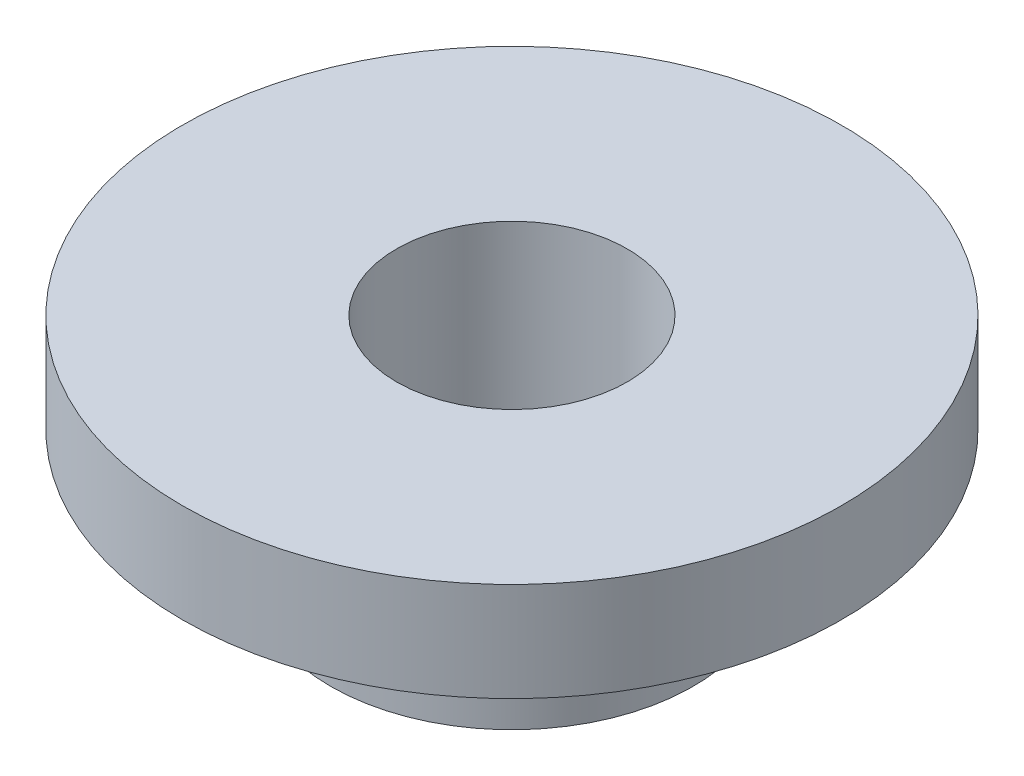
ISO-10303-21;
HEADER;
FILE_DESCRIPTION(('STEP AP214'),'2;1');
FILE_NAME('part.step','',(''),(''),'','','');
FILE_SCHEMA(('AUTOMOTIVE_DESIGN { 1 0 10303 214 1 1 1 1 }'));
ENDSEC;
DATA;
#1=APPLICATION_CONTEXT('core data for automotive mechanical design processes');
#2=APPLICATION_PROTOCOL_DEFINITION('international standard','automotive_design',2000,#1);
#3=PRODUCT_CONTEXT('',#1,'mechanical');
#4=PRODUCT('Part','Part','',(#3));
#5=PRODUCT_RELATED_PRODUCT_CATEGORY('part','',(#4));
#6=PRODUCT_DEFINITION_FORMATION('','',#4);
#7=PRODUCT_DEFINITION_CONTEXT('part definition',#1,'design');
#8=PRODUCT_DEFINITION('design','',#6,#7);
#9=PRODUCT_DEFINITION_SHAPE('','',#8);
#10=(LENGTH_UNIT() NAMED_UNIT(*) SI_UNIT(.MILLI.,.METRE.));
#11=(NAMED_UNIT(*) PLANE_ANGLE_UNIT() SI_UNIT($,.RADIAN.));
#12=(NAMED_UNIT(*) SI_UNIT($,.STERADIAN.) SOLID_ANGLE_UNIT());
#13=UNCERTAINTY_MEASURE_WITH_UNIT(LENGTH_MEASURE(1.E-05),#10,'distance_accuracy_value','');
#14=(GEOMETRIC_REPRESENTATION_CONTEXT(3) GLOBAL_UNCERTAINTY_ASSIGNED_CONTEXT((#13)) GLOBAL_UNIT_ASSIGNED_CONTEXT((#10,
#11,#12)) REPRESENTATION_CONTEXT('',''));
#15=CARTESIAN_POINT('',(0.,0.,0.));
#16=DIRECTION('',(0.,0.,1.));
#17=DIRECTION('',(1.,0.,0.));
#18=AXIS2_PLACEMENT_3D('',#15,#16,#17);
#19=CARTESIAN_POINT('',(-25.4,2.572,-2.66050878019847E-13));
#20=DIRECTION('',(0.,1.,0.));
#21=DIRECTION('',(0.,0.,1.));
#22=AXIS2_PLACEMENT_3D('',#19,#20,#21);
#23=CYLINDRICAL_SURFACE('',#22,2.75);
#24=CARTESIAN_POINT('',(-25.4,2.572,-2.66050878019847E-13));
#25=DIRECTION('',(0.,1.,0.));
#26=DIRECTION('',(0.,0.,1.));
#27=AXIS2_PLACEMENT_3D('',#24,#25,#26);
#28=CIRCLE('',#27,2.75);
#29=CARTESIAN_POINT('',(-25.4,2.572,2.74999999999973));
#30=VERTEX_POINT('',#29);
#31=EDGE_CURVE('E10',#30,#30,#28,.T.);
#32=ORIENTED_EDGE('',*,*,#31,.T.);
#33=EDGE_LOOP('',(#32));
#34=FACE_BOUND('',#33,.T.);
#35=CARTESIAN_POINT('',(-25.4,4.572,-2.66050878019847E-13));
#36=DIRECTION('',(0.,1.,0.));
#37=DIRECTION('',(0.,0.,1.));
#38=AXIS2_PLACEMENT_3D('',#35,#36,#37);
#39=CIRCLE('',#38,2.75);
#40=CARTESIAN_POINT('',(-25.4,4.572,2.74999999999973));
#41=VERTEX_POINT('',#40);
#42=EDGE_CURVE('E42',#41,#41,#39,.T.);
#43=ORIENTED_EDGE('',*,*,#42,.F.);
#44=EDGE_LOOP('',(#43));
#45=FACE_BOUND('',#44,.T.);
#46=ADVANCED_FACE('F39',(#34,#45),#23,.T.);
#47=CARTESIAN_POINT('',(-25.4,2.572,-2.66050878019847E-13));
#48=DIRECTION('',(0.,1.,0.));
#49=DIRECTION('',(0.,0.,1.));
#50=AXIS2_PLACEMENT_3D('',#47,#48,#49);
#51=PLANE('',#50);
#52=CARTESIAN_POINT('',(-25.4,2.572,-2.66050878019847E-13));
#53=DIRECTION('',(0.,1.,0.));
#54=DIRECTION('',(0.,0.,1.));
#55=AXIS2_PLACEMENT_3D('',#52,#53,#54);
#56=CIRCLE('',#55,1.75);
#57=CARTESIAN_POINT('',(-25.4,2.572,1.74999999999973));
#58=VERTEX_POINT('',#57);
#59=EDGE_CURVE('E51',#58,#58,#56,.T.);
#60=ORIENTED_EDGE('',*,*,#59,.T.);
#61=EDGE_LOOP('',(#60));
#62=FACE_BOUND('',#61,.T.);
#63=ORIENTED_EDGE('',*,*,#31,.F.);
#64=EDGE_LOOP('',(#63));
#65=FACE_BOUND('',#64,.T.);
#66=ADVANCED_FACE('F83',(#62,#65),#51,.F.);
#67=CARTESIAN_POINT('',(-25.4,2.572,-2.66050878019847E-13));
#68=DIRECTION('',(0.,1.,0.));
#69=DIRECTION('',(0.,0.,1.));
#70=AXIS2_PLACEMENT_3D('',#67,#68,#69);
#71=CYLINDRICAL_SURFACE('',#70,1.75);
#72=ORIENTED_EDGE('',*,*,#59,.F.);
#73=EDGE_LOOP('',(#72));
#74=FACE_BOUND('',#73,.T.);
#75=CARTESIAN_POINT('',(-25.4,6.072,-2.66050878019847E-13));
#76=DIRECTION('',(0.,1.,0.));
#77=DIRECTION('',(0.,0.,1.));
#78=AXIS2_PLACEMENT_3D('',#75,#76,#77);
#79=CIRCLE('',#78,1.75);
#80=CARTESIAN_POINT('',(-25.4,6.072,1.74999999999973));
#81=VERTEX_POINT('',#80);
#82=EDGE_CURVE('E61',#81,#81,#79,.T.);
#83=ORIENTED_EDGE('',*,*,#82,.T.);
#84=EDGE_LOOP('',(#83));
#85=FACE_BOUND('',#84,.T.);
#86=ADVANCED_FACE('F69',(#74,#85),#71,.F.);
#87=CARTESIAN_POINT('',(-25.4,6.072,-2.66050878019847E-13));
#88=DIRECTION('',(0.,1.,0.));
#89=DIRECTION('',(0.,0.,1.));
#90=AXIS2_PLACEMENT_3D('',#87,#88,#89);
#91=PLANE('',#90);
#92=CARTESIAN_POINT('',(-25.4,6.072,-2.66050878019847E-13));
#93=DIRECTION('',(0.,1.,0.));
#94=DIRECTION('',(0.,0.,1.));
#95=AXIS2_PLACEMENT_3D('',#92,#93,#94);
#96=CIRCLE('',#95,5.);
#97=CARTESIAN_POINT('',(-25.4,6.072,4.99999999999973));
#98=VERTEX_POINT('',#97);
#99=EDGE_CURVE('E56',#98,#98,#96,.T.);
#100=ORIENTED_EDGE('',*,*,#99,.T.);
#101=EDGE_LOOP('',(#100));
#102=FACE_BOUND('',#101,.T.);
#103=ORIENTED_EDGE('',*,*,#82,.F.);
#104=EDGE_LOOP('',(#103));
#105=FACE_BOUND('',#104,.T.);
#106=ADVANCED_FACE('F71',(#102,#105),#91,.T.);
#107=CARTESIAN_POINT('',(-25.4,4.572,-2.66050878019847E-13));
#108=DIRECTION('',(0.,1.,0.));
#109=DIRECTION('',(0.,0.,1.));
#110=AXIS2_PLACEMENT_3D('',#107,#108,#109);
#111=PLANE('',#110);
#112=ORIENTED_EDGE('',*,*,#42,.T.);
#113=EDGE_LOOP('',(#112));
#114=FACE_BOUND('',#113,.T.);
#115=CARTESIAN_POINT('',(-25.4,4.572,-2.66050878019847E-13));
#116=DIRECTION('',(0.,1.,0.));
#117=DIRECTION('',(0.,0.,1.));
#118=AXIS2_PLACEMENT_3D('',#115,#116,#117);
#119=CIRCLE('',#118,5.);
#120=CARTESIAN_POINT('',(-25.4,4.572,4.99999999999973));
#121=VERTEX_POINT('',#120);
#122=EDGE_CURVE('E57',#121,#121,#119,.T.);
#123=ORIENTED_EDGE('',*,*,#122,.F.);
#124=EDGE_LOOP('',(#123));
#125=FACE_BOUND('',#124,.T.);
#126=ADVANCED_FACE('F73',(#114,#125),#111,.F.);
#127=CARTESIAN_POINT('',(-25.4,6.072,-2.66050878019847E-13));
#128=DIRECTION('',(0.,-1.,0.));
#129=DIRECTION('',(0.,0.,-1.));
#130=AXIS2_PLACEMENT_3D('',#127,#128,#129);
#131=CYLINDRICAL_SURFACE('',#130,5.);
#132=ORIENTED_EDGE('',*,*,#99,.F.);
#133=EDGE_LOOP('',(#132));
#134=FACE_BOUND('',#133,.T.);
#135=ORIENTED_EDGE('',*,*,#122,.T.);
#136=EDGE_LOOP('',(#135));
#137=FACE_BOUND('',#136,.T.);
#138=ADVANCED_FACE('F80',(#134,#137),#131,.T.);
#139=CLOSED_SHELL('',(#46,#66,#86,#106,#126,#138));
#140=MANIFOLD_SOLID_BREP('B2',#139);
#141=ADVANCED_BREP_SHAPE_REPRESENTATION('',(#18,#140),#14);
#142=SHAPE_DEFINITION_REPRESENTATION(#9,#141);
ENDSEC;
END-ISO-10303-21;
